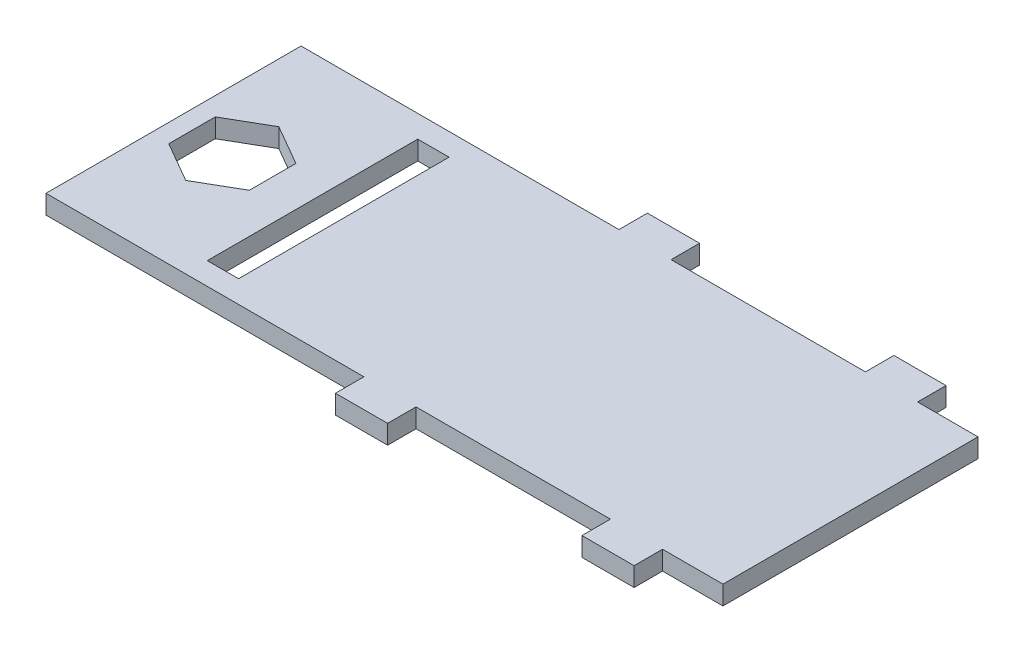
ISO-10303-21;
HEADER;
FILE_DESCRIPTION(('STEP AP214'),'2;1');
FILE_NAME('part.step','',(''),(''),'','','');
FILE_SCHEMA(('AUTOMOTIVE_DESIGN { 1 0 10303 214 1 1 1 1 }'));
ENDSEC;
DATA;
#1=APPLICATION_CONTEXT('core data for automotive mechanical design processes');
#2=APPLICATION_PROTOCOL_DEFINITION('international standard','automotive_design',2000,#1);
#3=PRODUCT_CONTEXT('',#1,'mechanical');
#4=PRODUCT('Part','Part','',(#3));
#5=PRODUCT_RELATED_PRODUCT_CATEGORY('part','',(#4));
#6=PRODUCT_DEFINITION_FORMATION('','',#4);
#7=PRODUCT_DEFINITION_CONTEXT('part definition',#1,'design');
#8=PRODUCT_DEFINITION('design','',#6,#7);
#9=PRODUCT_DEFINITION_SHAPE('','',#8);
#10=(LENGTH_UNIT() NAMED_UNIT(*) SI_UNIT(.MILLI.,.METRE.));
#11=(NAMED_UNIT(*) PLANE_ANGLE_UNIT() SI_UNIT($,.RADIAN.));
#12=(NAMED_UNIT(*) SI_UNIT($,.STERADIAN.) SOLID_ANGLE_UNIT());
#13=UNCERTAINTY_MEASURE_WITH_UNIT(LENGTH_MEASURE(1.E-05),#10,'distance_accuracy_value','');
#14=(GEOMETRIC_REPRESENTATION_CONTEXT(3) GLOBAL_UNCERTAINTY_ASSIGNED_CONTEXT((#13)) GLOBAL_UNIT_ASSIGNED_CONTEXT((#10,
#11,#12)) REPRESENTATION_CONTEXT('',''));
#15=CARTESIAN_POINT('',(0.,0.,0.));
#16=DIRECTION('',(0.,0.,1.));
#17=DIRECTION('',(1.,0.,0.));
#18=AXIS2_PLACEMENT_3D('',#15,#16,#17);
#19=CARTESIAN_POINT('',(-50.7984236509872,1.,18.7804542334295));
#20=DIRECTION('',(0.,0.,-1.));
#21=DIRECTION('',(-1.,0.,0.));
#22=AXIS2_PLACEMENT_3D('',#19,#20,#21);
#23=PLANE('',#22);
#24=DIRECTION('',(0.,-1.,0.));
#25=VECTOR('',#24,1.);
#26=CARTESIAN_POINT('',(-21.0334236509872,1.,18.7804542334295));
#27=LINE('',#26,#25);
#28=CARTESIAN_POINT('',(-21.0334236509872,1.,18.7804542334295));
#29=VERTEX_POINT('',#28);
#30=CARTESIAN_POINT('',(-21.0334236509872,0.,18.7804542334295));
#31=VERTEX_POINT('',#30);
#32=EDGE_CURVE('E327',#29,#31,#27,.T.);
#33=ORIENTED_EDGE('',*,*,#32,.F.);
#34=DIRECTION('',(1.,0.,0.));
#35=VECTOR('',#34,1.);
#36=CARTESIAN_POINT('',(-50.7984236509872,1.,18.7804542334295));
#37=LINE('',#36,#35);
#38=CARTESIAN_POINT('',(-31.2834236509872,1.,18.7804542334295));
#39=VERTEX_POINT('',#38);
#40=EDGE_CURVE('E513',#39,#29,#37,.T.);
#41=ORIENTED_EDGE('',*,*,#40,.F.);
#42=DIRECTION('',(0.,-1.,0.));
#43=VECTOR('',#42,1.);
#44=CARTESIAN_POINT('',(-31.2834236509872,1.,18.7804542334295));
#45=LINE('',#44,#43);
#46=CARTESIAN_POINT('',(-31.2834236509872,0.,18.7804542334295));
#47=VERTEX_POINT('',#46);
#48=EDGE_CURVE('E387',#39,#47,#45,.T.);
#49=ORIENTED_EDGE('',*,*,#48,.T.);
#50=DIRECTION('',(1.,0.,0.));
#51=VECTOR('',#50,1.);
#52=CARTESIAN_POINT('',(-50.7984236509872,0.,18.7804542334295));
#53=LINE('',#52,#51);
#54=EDGE_CURVE('E452',#47,#31,#53,.T.);
#55=ORIENTED_EDGE('',*,*,#54,.T.);
#56=EDGE_LOOP('',(#33,#41,#49,#55));
#57=FACE_BOUND('',#56,.T.);
#58=ADVANCED_FACE('F33',(#57),#23,.F.);
#59=DIRECTION('',(0.,-1.,0.));
#60=VECTOR('',#59,1.);
#61=CARTESIAN_POINT('',(-18.2834236509872,1.,18.7804542334295));
#62=LINE('',#61,#60);
#63=CARTESIAN_POINT('',(-18.2834236509872,1.,18.7804542334295));
#64=VERTEX_POINT('',#63);
#65=CARTESIAN_POINT('',(-18.2834236509872,0.,18.7804542334295));
#66=VERTEX_POINT('',#65);
#67=EDGE_CURVE('E336',#64,#66,#62,.T.);
#68=ORIENTED_EDGE('',*,*,#67,.T.);
#69=CARTESIAN_POINT('',(-15.0984236509872,0.,18.7804542334295));
#70=VERTEX_POINT('',#69);
#71=EDGE_CURVE('E446',#66,#70,#53,.T.);
#72=ORIENTED_EDGE('',*,*,#71,.T.);
#73=DIRECTION('',(0.,-1.,0.));
#74=VECTOR('',#73,1.);
#75=CARTESIAN_POINT('',(-15.0984236509872,1.,18.7804542334295));
#76=LINE('',#75,#74);
#77=CARTESIAN_POINT('',(-15.0984236509872,1.,18.7804542334295));
#78=VERTEX_POINT('',#77);
#79=EDGE_CURVE('E43',#78,#70,#76,.T.);
#80=ORIENTED_EDGE('',*,*,#79,.F.);
#81=EDGE_CURVE('E37',#64,#78,#37,.T.);
#82=ORIENTED_EDGE('',*,*,#81,.F.);
#83=EDGE_LOOP('',(#68,#72,#80,#82));
#84=FACE_BOUND('',#83,.T.);
#85=ADVANCED_FACE('F552',(#84),#23,.F.);
#86=CARTESIAN_POINT('',(-50.7984236509872,1.,5.33045423342954));
#87=DIRECTION('',(0.,0.,1.));
#88=DIRECTION('',(1.,0.,0.));
#89=AXIS2_PLACEMENT_3D('',#86,#87,#88);
#90=PLANE('',#89);
#91=DIRECTION('',(0.,-1.,0.));
#92=VECTOR('',#91,1.);
#93=CARTESIAN_POINT('',(-18.2834236509872,1.,5.33045423342954));
#94=LINE('',#93,#92);
#95=CARTESIAN_POINT('',(-18.2834236509872,1.,5.33045423342954));
#96=VERTEX_POINT('',#95);
#97=CARTESIAN_POINT('',(-18.2834236509872,0.,5.33045423342954));
#98=VERTEX_POINT('',#97);
#99=EDGE_CURVE('E368',#96,#98,#94,.T.);
#100=ORIENTED_EDGE('',*,*,#99,.F.);
#101=DIRECTION('',(-1.,0.,0.));
#102=VECTOR('',#101,1.);
#103=CARTESIAN_POINT('',(-50.7984236509872,1.,5.33045423342954));
#104=LINE('',#103,#102);
#105=CARTESIAN_POINT('',(-15.0984236509872,1.,5.33045423342954));
#106=VERTEX_POINT('',#105);
#107=EDGE_CURVE('E427',#106,#96,#104,.T.);
#108=ORIENTED_EDGE('',*,*,#107,.F.);
#109=DIRECTION('',(0.,-1.,0.));
#110=VECTOR('',#109,1.);
#111=CARTESIAN_POINT('',(-15.0984236509872,1.,5.33045423342954));
#112=LINE('',#111,#110);
#113=CARTESIAN_POINT('',(-15.0984236509872,0.,5.33045423342954));
#114=VERTEX_POINT('',#113);
#115=EDGE_CURVE('E420',#106,#114,#112,.T.);
#116=ORIENTED_EDGE('',*,*,#115,.T.);
#117=DIRECTION('',(-1.,0.,0.));
#118=VECTOR('',#117,1.);
#119=CARTESIAN_POINT('',(-50.7984236509872,0.,5.33045423342954));
#120=LINE('',#119,#118);
#121=EDGE_CURVE('E401',#114,#98,#120,.T.);
#122=ORIENTED_EDGE('',*,*,#121,.T.);
#123=EDGE_LOOP('',(#100,#108,#116,#122));
#124=FACE_BOUND('',#123,.T.);
#125=ADVANCED_FACE('F578',(#124),#90,.F.);
#126=DIRECTION('',(0.,-1.,0.));
#127=VECTOR('',#126,1.);
#128=CARTESIAN_POINT('',(-21.0334236509872,1.,5.33045423342954));
#129=LINE('',#128,#127);
#130=CARTESIAN_POINT('',(-21.0334236509872,1.,5.33045423342954));
#131=VERTEX_POINT('',#130);
#132=CARTESIAN_POINT('',(-21.0334236509872,0.,5.33045423342954));
#133=VERTEX_POINT('',#132);
#134=EDGE_CURVE('E354',#131,#133,#129,.T.);
#135=ORIENTED_EDGE('',*,*,#134,.T.);
#136=CARTESIAN_POINT('',(-31.2834236509872,0.,5.33045423342954));
#137=VERTEX_POINT('',#136);
#138=EDGE_CURVE('E398',#133,#137,#120,.T.);
#139=ORIENTED_EDGE('',*,*,#138,.T.);
#140=DIRECTION('',(0.,-1.,0.));
#141=VECTOR('',#140,1.);
#142=CARTESIAN_POINT('',(-31.2834236509872,1.,5.33045423342954));
#143=LINE('',#142,#141);
#144=CARTESIAN_POINT('',(-31.2834236509872,1.,5.33045423342954));
#145=VERTEX_POINT('',#144);
#146=EDGE_CURVE('E470',#145,#137,#143,.T.);
#147=ORIENTED_EDGE('',*,*,#146,.F.);
#148=EDGE_CURVE('E403',#131,#145,#104,.T.);
#149=ORIENTED_EDGE('',*,*,#148,.F.);
#150=EDGE_LOOP('',(#135,#139,#147,#149));
#151=FACE_BOUND('',#150,.T.);
#152=ADVANCED_FACE('F581',(#151),#90,.F.);
#153=DIRECTION('',(0.,-1.,0.));
#154=VECTOR('',#153,1.);
#155=CARTESIAN_POINT('',(-34.0334236509872,1.,18.7804542334295));
#156=LINE('',#155,#154);
#157=CARTESIAN_POINT('',(-34.0334236509872,1.,18.7804542334295));
#158=VERTEX_POINT('',#157);
#159=CARTESIAN_POINT('',(-34.0334236509872,0.,18.7804542334295));
#160=VERTEX_POINT('',#159);
#161=EDGE_CURVE('E384',#158,#160,#156,.T.);
#162=ORIENTED_EDGE('',*,*,#161,.F.);
#163=CARTESIAN_POINT('',(-50.7984236509872,1.,18.7804542334295));
#164=VERTEX_POINT('',#163);
#165=EDGE_CURVE('E510',#164,#158,#37,.T.);
#166=ORIENTED_EDGE('',*,*,#165,.F.);
#167=DIRECTION('',(0.,-1.,0.));
#168=VECTOR('',#167,1.);
#169=CARTESIAN_POINT('',(-50.7984236509872,1.,18.7804542334295));
#170=LINE('',#169,#168);
#171=CARTESIAN_POINT('',(-50.7984236509872,0.,18.7804542334295));
#172=VERTEX_POINT('',#171);
#173=EDGE_CURVE('E11',#164,#172,#170,.T.);
#174=ORIENTED_EDGE('',*,*,#173,.T.);
#175=EDGE_CURVE('E455',#172,#160,#53,.T.);
#176=ORIENTED_EDGE('',*,*,#175,.T.);
#177=EDGE_LOOP('',(#162,#166,#174,#176));
#178=FACE_BOUND('',#177,.T.);
#179=ADVANCED_FACE('F556',(#178),#23,.F.);
#180=CARTESIAN_POINT('',(-50.7984236509872,1.,5.33045423342954));
#181=DIRECTION('',(1.,0.,0.));
#182=DIRECTION('',(0.,0.,-1.));
#183=AXIS2_PLACEMENT_3D('',#180,#181,#182);
#184=PLANE('',#183);
#185=DIRECTION('',(0.,0.,1.));
#186=VECTOR('',#185,1.);
#187=CARTESIAN_POINT('',(-50.7984236509872,0.,5.33045423342954));
#188=LINE('',#187,#186);
#189=CARTESIAN_POINT('',(-50.7984236509872,0.,5.33045423342954));
#190=VERTEX_POINT('',#189);
#191=EDGE_CURVE('E443',#190,#172,#188,.T.);
#192=ORIENTED_EDGE('',*,*,#191,.T.);
#193=ORIENTED_EDGE('',*,*,#173,.F.);
#194=DIRECTION('',(0.,0.,1.));
#195=VECTOR('',#194,1.);
#196=CARTESIAN_POINT('',(-50.7984236509872,1.,5.33045423342954));
#197=LINE('',#196,#195);
#198=CARTESIAN_POINT('',(-50.7984236509872,1.,5.33045423342954));
#199=VERTEX_POINT('',#198);
#200=EDGE_CURVE('E417',#199,#164,#197,.T.);
#201=ORIENTED_EDGE('',*,*,#200,.F.);
#202=DIRECTION('',(0.,-1.,0.));
#203=VECTOR('',#202,1.);
#204=CARTESIAN_POINT('',(-50.7984236509872,1.,5.33045423342954));
#205=LINE('',#204,#203);
#206=EDGE_CURVE('E410',#199,#190,#205,.T.);
#207=ORIENTED_EDGE('',*,*,#206,.T.);
#208=EDGE_LOOP('',(#192,#193,#201,#207));
#209=FACE_BOUND('',#208,.T.);
#210=ADVANCED_FACE('F35',(#209),#184,.F.);
#211=CARTESIAN_POINT('',(-15.0984236509872,1.,5.33045423342954));
#212=DIRECTION('',(-1.,0.,0.));
#213=DIRECTION('',(0.,0.,1.));
#214=AXIS2_PLACEMENT_3D('',#211,#212,#213);
#215=PLANE('',#214);
#216=DIRECTION('',(0.,0.,-1.));
#217=VECTOR('',#216,1.);
#218=CARTESIAN_POINT('',(-15.0984236509872,0.,5.33045423342954));
#219=LINE('',#218,#217);
#220=EDGE_CURVE('E408',#70,#114,#219,.T.);
#221=ORIENTED_EDGE('',*,*,#220,.T.);
#222=ORIENTED_EDGE('',*,*,#115,.F.);
#223=DIRECTION('',(0.,0.,-1.));
#224=VECTOR('',#223,1.);
#225=CARTESIAN_POINT('',(-15.0984236509872,1.,5.33045423342954));
#226=LINE('',#225,#224);
#227=EDGE_CURVE('E442',#78,#106,#226,.T.);
#228=ORIENTED_EDGE('',*,*,#227,.F.);
#229=ORIENTED_EDGE('',*,*,#79,.T.);
#230=EDGE_LOOP('',(#221,#222,#228,#229));
#231=FACE_BOUND('',#230,.T.);
#232=ADVANCED_FACE('F586',(#231),#215,.F.);
#233=CARTESIAN_POINT('',(-34.0334236509872,1.,5.33045423342954));
#234=VERTEX_POINT('',#233);
#235=EDGE_CURVE('E436',#234,#199,#104,.T.);
#236=ORIENTED_EDGE('',*,*,#235,.F.);
#237=DIRECTION('',(0.,-1.,0.));
#238=VECTOR('',#237,1.);
#239=CARTESIAN_POINT('',(-34.0334236509872,1.,5.33045423342954));
#240=LINE('',#239,#238);
#241=CARTESIAN_POINT('',(-34.0334236509872,0.,5.33045423342954));
#242=VERTEX_POINT('',#241);
#243=EDGE_CURVE('E447',#234,#242,#240,.T.);
#244=ORIENTED_EDGE('',*,*,#243,.T.);
#245=EDGE_CURVE('E402',#242,#190,#120,.T.);
#246=ORIENTED_EDGE('',*,*,#245,.T.);
#247=ORIENTED_EDGE('',*,*,#206,.F.);
#248=EDGE_LOOP('',(#236,#244,#246,#247));
#249=FACE_BOUND('',#248,.T.);
#250=ADVANCED_FACE('F509',(#249),#90,.F.);
#251=CARTESIAN_POINT('',(0.,1.,0.));
#252=DIRECTION('',(0.,1.,0.));
#253=DIRECTION('',(0.,0.,1.));
#254=AXIS2_PLACEMENT_3D('',#251,#252,#253);
#255=PLANE('',#254);
#256=DIRECTION('',(-0.866025403784439,0.,-0.5));
#257=VECTOR('',#256,1.);
#258=CARTESIAN_POINT('',(-47.6984236509872,1.,14.5091928774854));
#259=LINE('',#258,#257);
#260=CARTESIAN_POINT('',(-47.6984236509872,1.,14.5091928774854));
#261=VERTEX_POINT('',#260);
#262=CARTESIAN_POINT('',(-49.8234236509872,1.,13.2823235554575));
#263=VERTEX_POINT('',#262);
#264=EDGE_CURVE('E235',#261,#263,#259,.T.);
#265=ORIENTED_EDGE('',*,*,#264,.T.);
#266=DIRECTION('',(0.,0.,-1.));
#267=VECTOR('',#266,1.);
#268=CARTESIAN_POINT('',(-49.8234236509872,1.,13.2823235554575));
#269=LINE('',#268,#267);
#270=CARTESIAN_POINT('',(-49.8234236509872,1.,10.8285849114016));
#271=VERTEX_POINT('',#270);
#272=EDGE_CURVE('E244',#263,#271,#269,.T.);
#273=ORIENTED_EDGE('',*,*,#272,.T.);
#274=DIRECTION('',(0.866025403784439,0.,-0.5));
#275=VECTOR('',#274,1.);
#276=CARTESIAN_POINT('',(-49.8234236509872,1.,10.8285849114016));
#277=LINE('',#276,#275);
#278=CARTESIAN_POINT('',(-47.6984236509872,1.,9.60171558937365));
#279=VERTEX_POINT('',#278);
#280=EDGE_CURVE('E51',#271,#279,#277,.T.);
#281=ORIENTED_EDGE('',*,*,#280,.T.);
#282=DIRECTION('',(0.866025403784438,0.,0.5));
#283=VECTOR('',#282,1.);
#284=CARTESIAN_POINT('',(-47.6984236509872,1.,9.60171558937365));
#285=LINE('',#284,#283);
#286=CARTESIAN_POINT('',(-45.5734236509872,1.,10.8285849114016));
#287=VERTEX_POINT('',#286);
#288=EDGE_CURVE('E259',#279,#287,#285,.T.);
#289=ORIENTED_EDGE('',*,*,#288,.T.);
#290=DIRECTION('',(0.,0.,1.));
#291=VECTOR('',#290,1.);
#292=CARTESIAN_POINT('',(-45.5734236509872,1.,10.8285849114016));
#293=LINE('',#292,#291);
#294=CARTESIAN_POINT('',(-45.5734236509872,1.,13.2823235554575));
#295=VERTEX_POINT('',#294);
#296=EDGE_CURVE('E262',#287,#295,#293,.T.);
#297=ORIENTED_EDGE('',*,*,#296,.T.);
#298=DIRECTION('',(-0.866025403784439,0.,0.5));
#299=VECTOR('',#298,1.);
#300=CARTESIAN_POINT('',(-45.5734236509872,1.,13.2823235554575));
#301=LINE('',#300,#299);
#302=EDGE_CURVE('E241',#295,#261,#301,.T.);
#303=ORIENTED_EDGE('',*,*,#302,.T.);
#304=EDGE_LOOP('',(#265,#273,#281,#289,#297,#303));
#305=FACE_BOUND('',#304,.T.);
#306=DIRECTION('',(0.,0.,-1.));
#307=VECTOR('',#306,1.);
#308=CARTESIAN_POINT('',(-43.4684236509872,1.,17.6054542334295));
#309=LINE('',#308,#307);
#310=CARTESIAN_POINT('',(-43.4684236509872,1.,17.6054542334295));
#311=VERTEX_POINT('',#310);
#312=CARTESIAN_POINT('',(-43.4684236509872,1.,6.50545423342955));
#313=VERTEX_POINT('',#312);
#314=EDGE_CURVE('E286',#311,#313,#309,.T.);
#315=ORIENTED_EDGE('',*,*,#314,.T.);
#316=DIRECTION('',(1.,0.,0.));
#317=VECTOR('',#316,1.);
#318=CARTESIAN_POINT('',(-43.4684236509872,1.,6.50545423342955));
#319=LINE('',#318,#317);
#320=CARTESIAN_POINT('',(-41.8184236509872,1.,6.50545423342955));
#321=VERTEX_POINT('',#320);
#322=EDGE_CURVE('E289',#313,#321,#319,.T.);
#323=ORIENTED_EDGE('',*,*,#322,.T.);
#324=DIRECTION('',(0.,0.,1.));
#325=VECTOR('',#324,1.);
#326=CARTESIAN_POINT('',(-41.8184236509872,1.,17.6054542334296));
#327=LINE('',#326,#325);
#328=CARTESIAN_POINT('',(-41.8184236509872,1.,17.6054542334296));
#329=VERTEX_POINT('',#328);
#330=EDGE_CURVE('E293',#321,#329,#327,.T.);
#331=ORIENTED_EDGE('',*,*,#330,.T.);
#332=DIRECTION('',(-1.,0.,0.));
#333=VECTOR('',#332,1.);
#334=CARTESIAN_POINT('',(-43.4684236509872,1.,17.6054542334295));
#335=LINE('',#334,#333);
#336=EDGE_CURVE('E296',#329,#311,#335,.T.);
#337=ORIENTED_EDGE('',*,*,#336,.T.);
#338=EDGE_LOOP('',(#315,#323,#331,#337));
#339=FACE_BOUND('',#338,.T.);
#340=ORIENTED_EDGE('',*,*,#200,.T.);
#341=ORIENTED_EDGE('',*,*,#165,.T.);
#342=DIRECTION('',(0.,0.,1.));
#343=VECTOR('',#342,1.);
#344=CARTESIAN_POINT('',(-34.0334236509872,1.,18.7804542334295));
#345=LINE('',#344,#343);
#346=CARTESIAN_POINT('',(-34.0334236509872,1.,20.2804542334295));
#347=VERTEX_POINT('',#346);
#348=EDGE_CURVE('E375',#158,#347,#345,.T.);
#349=ORIENTED_EDGE('',*,*,#348,.T.);
#350=DIRECTION('',(1.,0.,0.));
#351=VECTOR('',#350,1.);
#352=CARTESIAN_POINT('',(-34.0334236509872,1.,20.2804542334295));
#353=LINE('',#352,#351);
#354=CARTESIAN_POINT('',(-31.2834236509872,1.,20.2804542334295));
#355=VERTEX_POINT('',#354);
#356=EDGE_CURVE('E372',#347,#355,#353,.T.);
#357=ORIENTED_EDGE('',*,*,#356,.T.);
#358=DIRECTION('',(0.,0.,-1.));
#359=VECTOR('',#358,1.);
#360=CARTESIAN_POINT('',(-31.2834236509872,1.,18.7804542334295));
#361=LINE('',#360,#359);
#362=EDGE_CURVE('E374',#355,#39,#361,.T.);
#363=ORIENTED_EDGE('',*,*,#362,.T.);
#364=ORIENTED_EDGE('',*,*,#40,.T.);
#365=DIRECTION('',(0.,0.,1.));
#366=VECTOR('',#365,1.);
#367=CARTESIAN_POINT('',(-21.0334236509872,1.,18.7804542334295));
#368=LINE('',#367,#366);
#369=CARTESIAN_POINT('',(-21.0334236509872,1.,20.2804542334295));
#370=VERTEX_POINT('',#369);
#371=EDGE_CURVE('E318',#29,#370,#368,.T.);
#372=ORIENTED_EDGE('',*,*,#371,.T.);
#373=DIRECTION('',(1.,0.,0.));
#374=VECTOR('',#373,1.);
#375=CARTESIAN_POINT('',(-21.0334236509872,1.,20.2804542334295));
#376=LINE('',#375,#374);
#377=CARTESIAN_POINT('',(-18.2834236509872,1.,20.2804542334295));
#378=VERTEX_POINT('',#377);
#379=EDGE_CURVE('E321',#370,#378,#376,.T.);
#380=ORIENTED_EDGE('',*,*,#379,.T.);
#381=DIRECTION('',(0.,0.,-1.));
#382=VECTOR('',#381,1.);
#383=CARTESIAN_POINT('',(-18.2834236509872,1.,18.7804542334295));
#384=LINE('',#383,#382);
#385=EDGE_CURVE('E324',#378,#64,#384,.T.);
#386=ORIENTED_EDGE('',*,*,#385,.T.);
#387=ORIENTED_EDGE('',*,*,#81,.T.);
#388=ORIENTED_EDGE('',*,*,#227,.T.);
#389=ORIENTED_EDGE('',*,*,#107,.T.);
#390=DIRECTION('',(0.,0.,-1.));
#391=VECTOR('',#390,1.);
#392=CARTESIAN_POINT('',(-18.2834236509872,1.,5.33045423342954));
#393=LINE('',#392,#391);
#394=CARTESIAN_POINT('',(-18.2834236509872,1.,3.83045423342955));
#395=VERTEX_POINT('',#394);
#396=EDGE_CURVE('E346',#96,#395,#393,.T.);
#397=ORIENTED_EDGE('',*,*,#396,.T.);
#398=DIRECTION('',(-1.,0.,0.));
#399=VECTOR('',#398,1.);
#400=CARTESIAN_POINT('',(-21.0334236509872,1.,3.83045423342955));
#401=LINE('',#400,#399);
#402=CARTESIAN_POINT('',(-21.0334236509872,1.,3.83045423342955));
#403=VERTEX_POINT('',#402);
#404=EDGE_CURVE('E348',#395,#403,#401,.T.);
#405=ORIENTED_EDGE('',*,*,#404,.T.);
#406=DIRECTION('',(0.,0.,1.));
#407=VECTOR('',#406,1.);
#408=CARTESIAN_POINT('',(-21.0334236509872,1.,5.33045423342954));
#409=LINE('',#408,#407);
#410=EDGE_CURVE('E351',#403,#131,#409,.T.);
#411=ORIENTED_EDGE('',*,*,#410,.T.);
#412=ORIENTED_EDGE('',*,*,#148,.T.);
#413=DIRECTION('',(0.,0.,-1.));
#414=VECTOR('',#413,1.);
#415=CARTESIAN_POINT('',(-31.2834236509872,1.,5.33045423342954));
#416=LINE('',#415,#414);
#417=CARTESIAN_POINT('',(-31.2834236509872,1.,3.83045423342955));
#418=VERTEX_POINT('',#417);
#419=EDGE_CURVE('E466',#145,#418,#416,.T.);
#420=ORIENTED_EDGE('',*,*,#419,.T.);
#421=DIRECTION('',(-1.,0.,0.));
#422=VECTOR('',#421,1.);
#423=CARTESIAN_POINT('',(-34.0334236509872,1.,3.83045423342955));
#424=LINE('',#423,#422);
#425=CARTESIAN_POINT('',(-34.0334236509872,1.,3.83045423342955));
#426=VERTEX_POINT('',#425);
#427=EDGE_CURVE('E468',#418,#426,#424,.T.);
#428=ORIENTED_EDGE('',*,*,#427,.T.);
#429=DIRECTION('',(0.,0.,1.));
#430=VECTOR('',#429,1.);
#431=CARTESIAN_POINT('',(-34.0334236509872,1.,5.33045423342954));
#432=LINE('',#431,#430);
#433=EDGE_CURVE('E469',#426,#234,#432,.T.);
#434=ORIENTED_EDGE('',*,*,#433,.T.);
#435=ORIENTED_EDGE('',*,*,#235,.T.);
#436=EDGE_LOOP('',(#340,#341,#349,#357,#363,#364,#372,#380,#386,#387,#388,#389,#397,#405,#411,
#412,#420,#428,#434,#435));
#437=FACE_BOUND('',#436,.T.);
#438=ADVANCED_FACE('F248',(#305,#339,#437),#255,.T.);
#439=CARTESIAN_POINT('',(0.,0.,0.));
#440=DIRECTION('',(0.,1.,0.));
#441=DIRECTION('',(0.,0.,1.));
#442=AXIS2_PLACEMENT_3D('',#439,#440,#441);
#443=PLANE('',#442);
#444=DIRECTION('',(0.,0.,-1.));
#445=VECTOR('',#444,1.);
#446=CARTESIAN_POINT('',(-49.8234236509872,0.,13.2823235554575));
#447=LINE('',#446,#445);
#448=CARTESIAN_POINT('',(-49.8234236509872,0.,13.2823235554575));
#449=VERTEX_POINT('',#448);
#450=CARTESIAN_POINT('',(-49.8234236509872,0.,10.8285849114016));
#451=VERTEX_POINT('',#450);
#452=EDGE_CURVE('E266',#449,#451,#447,.T.);
#453=ORIENTED_EDGE('',*,*,#452,.F.);
#454=DIRECTION('',(-0.866025403784439,0.,-0.5));
#455=VECTOR('',#454,1.);
#456=CARTESIAN_POINT('',(-47.6984236509872,0.,14.5091928774854));
#457=LINE('',#456,#455);
#458=CARTESIAN_POINT('',(-47.6984236509872,0.,14.5091928774854));
#459=VERTEX_POINT('',#458);
#460=EDGE_CURVE('E59',#459,#449,#457,.T.);
#461=ORIENTED_EDGE('',*,*,#460,.F.);
#462=DIRECTION('',(-0.866025403784439,0.,0.5));
#463=VECTOR('',#462,1.);
#464=CARTESIAN_POINT('',(-45.5734236509872,0.,13.2823235554575));
#465=LINE('',#464,#463);
#466=CARTESIAN_POINT('',(-45.5734236509872,0.,13.2823235554575));
#467=VERTEX_POINT('',#466);
#468=EDGE_CURVE('E252',#467,#459,#465,.T.);
#469=ORIENTED_EDGE('',*,*,#468,.F.);
#470=DIRECTION('',(0.,0.,1.));
#471=VECTOR('',#470,1.);
#472=CARTESIAN_POINT('',(-45.5734236509872,0.,10.8285849114016));
#473=LINE('',#472,#471);
#474=CARTESIAN_POINT('',(-45.5734236509872,0.,10.8285849114016));
#475=VERTEX_POINT('',#474);
#476=EDGE_CURVE('E255',#475,#467,#473,.T.);
#477=ORIENTED_EDGE('',*,*,#476,.F.);
#478=DIRECTION('',(0.866025403784438,0.,0.5));
#479=VECTOR('',#478,1.);
#480=CARTESIAN_POINT('',(-47.6984236509872,0.,9.60171558937365));
#481=LINE('',#480,#479);
#482=CARTESIAN_POINT('',(-47.6984236509872,0.,9.60171558937365));
#483=VERTEX_POINT('',#482);
#484=EDGE_CURVE('E271',#483,#475,#481,.T.);
#485=ORIENTED_EDGE('',*,*,#484,.F.);
#486=DIRECTION('',(0.866025403784439,0.,-0.5));
#487=VECTOR('',#486,1.);
#488=CARTESIAN_POINT('',(-49.8234236509872,0.,10.8285849114016));
#489=LINE('',#488,#487);
#490=EDGE_CURVE('E268',#451,#483,#489,.T.);
#491=ORIENTED_EDGE('',*,*,#490,.F.);
#492=EDGE_LOOP('',(#453,#461,#469,#477,#485,#491));
#493=FACE_BOUND('',#492,.T.);
#494=DIRECTION('',(1.,0.,0.));
#495=VECTOR('',#494,1.);
#496=CARTESIAN_POINT('',(-43.4684236509872,0.,6.50545423342955));
#497=LINE('',#496,#495);
#498=CARTESIAN_POINT('',(-43.4684236509872,0.,6.50545423342955));
#499=VERTEX_POINT('',#498);
#500=CARTESIAN_POINT('',(-41.8184236509872,0.,6.50545423342955));
#501=VERTEX_POINT('',#500);
#502=EDGE_CURVE('E301',#499,#501,#497,.T.);
#503=ORIENTED_EDGE('',*,*,#502,.F.);
#504=DIRECTION('',(0.,0.,-1.));
#505=VECTOR('',#504,1.);
#506=CARTESIAN_POINT('',(-43.4684236509872,0.,17.6054542334295));
#507=LINE('',#506,#505);
#508=CARTESIAN_POINT('',(-43.4684236509872,0.,17.6054542334295));
#509=VERTEX_POINT('',#508);
#510=EDGE_CURVE('E278',#509,#499,#507,.T.);
#511=ORIENTED_EDGE('',*,*,#510,.F.);
#512=DIRECTION('',(-1.,0.,0.));
#513=VECTOR('',#512,1.);
#514=CARTESIAN_POINT('',(-43.4684236509872,0.,17.6054542334295));
#515=LINE('',#514,#513);
#516=CARTESIAN_POINT('',(-41.8184236509872,0.,17.6054542334296));
#517=VERTEX_POINT('',#516);
#518=EDGE_CURVE('E290',#517,#509,#515,.T.);
#519=ORIENTED_EDGE('',*,*,#518,.F.);
#520=DIRECTION('',(0.,0.,1.));
#521=VECTOR('',#520,1.);
#522=CARTESIAN_POINT('',(-41.8184236509872,0.,17.6054542334296));
#523=LINE('',#522,#521);
#524=EDGE_CURVE('E304',#501,#517,#523,.T.);
#525=ORIENTED_EDGE('',*,*,#524,.F.);
#526=EDGE_LOOP('',(#503,#511,#519,#525));
#527=FACE_BOUND('',#526,.T.);
#528=ORIENTED_EDGE('',*,*,#191,.F.);
#529=ORIENTED_EDGE('',*,*,#245,.F.);
#530=DIRECTION('',(0.,0.,1.));
#531=VECTOR('',#530,1.);
#532=CARTESIAN_POINT('',(-34.0334236509872,0.,5.33045423342954));
#533=LINE('',#532,#531);
#534=CARTESIAN_POINT('',(-34.0334236509872,0.,3.83045423342955));
#535=VERTEX_POINT('',#534);
#536=EDGE_CURVE('E463',#535,#242,#533,.T.);
#537=ORIENTED_EDGE('',*,*,#536,.F.);
#538=DIRECTION('',(-1.,0.,0.));
#539=VECTOR('',#538,1.);
#540=CARTESIAN_POINT('',(-34.0334236509872,0.,3.83045423342955));
#541=LINE('',#540,#539);
#542=CARTESIAN_POINT('',(-31.2834236509872,0.,3.83045423342955));
#543=VERTEX_POINT('',#542);
#544=EDGE_CURVE('E462',#543,#535,#541,.T.);
#545=ORIENTED_EDGE('',*,*,#544,.F.);
#546=DIRECTION('',(0.,0.,-1.));
#547=VECTOR('',#546,1.);
#548=CARTESIAN_POINT('',(-31.2834236509872,0.,5.33045423342954));
#549=LINE('',#548,#547);
#550=EDGE_CURVE('E460',#137,#543,#549,.T.);
#551=ORIENTED_EDGE('',*,*,#550,.F.);
#552=ORIENTED_EDGE('',*,*,#138,.F.);
#553=DIRECTION('',(0.,0.,1.));
#554=VECTOR('',#553,1.);
#555=CARTESIAN_POINT('',(-21.0334236509872,0.,5.33045423342954));
#556=LINE('',#555,#554);
#557=CARTESIAN_POINT('',(-21.0334236509872,0.,3.83045423342955));
#558=VERTEX_POINT('',#557);
#559=EDGE_CURVE('E349',#558,#133,#556,.T.);
#560=ORIENTED_EDGE('',*,*,#559,.F.);
#561=DIRECTION('',(-1.,0.,0.));
#562=VECTOR('',#561,1.);
#563=CARTESIAN_POINT('',(-21.0334236509872,0.,3.83045423342955));
#564=LINE('',#563,#562);
#565=CARTESIAN_POINT('',(-18.2834236509872,0.,3.83045423342955));
#566=VERTEX_POINT('',#565);
#567=EDGE_CURVE('E356',#566,#558,#564,.T.);
#568=ORIENTED_EDGE('',*,*,#567,.F.);
#569=DIRECTION('',(0.,0.,-1.));
#570=VECTOR('',#569,1.);
#571=CARTESIAN_POINT('',(-18.2834236509872,0.,5.33045423342954));
#572=LINE('',#571,#570);
#573=EDGE_CURVE('E345',#98,#566,#572,.T.);
#574=ORIENTED_EDGE('',*,*,#573,.F.);
#575=ORIENTED_EDGE('',*,*,#121,.F.);
#576=ORIENTED_EDGE('',*,*,#220,.F.);
#577=ORIENTED_EDGE('',*,*,#71,.F.);
#578=DIRECTION('',(0.,0.,-1.));
#579=VECTOR('',#578,1.);
#580=CARTESIAN_POINT('',(-18.2834236509872,0.,18.7804542334295));
#581=LINE('',#580,#579);
#582=CARTESIAN_POINT('',(-18.2834236509872,0.,20.2804542334295));
#583=VERTEX_POINT('',#582);
#584=EDGE_CURVE('E322',#583,#66,#581,.T.);
#585=ORIENTED_EDGE('',*,*,#584,.F.);
#586=DIRECTION('',(1.,0.,0.));
#587=VECTOR('',#586,1.);
#588=CARTESIAN_POINT('',(-21.0334236509872,0.,20.2804542334295));
#589=LINE('',#588,#587);
#590=CARTESIAN_POINT('',(-21.0334236509872,0.,20.2804542334295));
#591=VERTEX_POINT('',#590);
#592=EDGE_CURVE('E330',#591,#583,#589,.T.);
#593=ORIENTED_EDGE('',*,*,#592,.F.);
#594=DIRECTION('',(0.,0.,1.));
#595=VECTOR('',#594,1.);
#596=CARTESIAN_POINT('',(-21.0334236509872,0.,18.7804542334295));
#597=LINE('',#596,#595);
#598=EDGE_CURVE('E311',#31,#591,#597,.T.);
#599=ORIENTED_EDGE('',*,*,#598,.F.);
#600=ORIENTED_EDGE('',*,*,#54,.F.);
#601=DIRECTION('',(0.,0.,-1.));
#602=VECTOR('',#601,1.);
#603=CARTESIAN_POINT('',(-31.2834236509872,0.,18.7804542334295));
#604=LINE('',#603,#602);
#605=CARTESIAN_POINT('',(-31.2834236509872,0.,20.2804542334295));
#606=VERTEX_POINT('',#605);
#607=EDGE_CURVE('E378',#606,#47,#604,.T.);
#608=ORIENTED_EDGE('',*,*,#607,.F.);
#609=DIRECTION('',(1.,0.,0.));
#610=VECTOR('',#609,1.);
#611=CARTESIAN_POINT('',(-34.0334236509872,0.,20.2804542334295));
#612=LINE('',#611,#610);
#613=CARTESIAN_POINT('',(-34.0334236509872,0.,20.2804542334295));
#614=VERTEX_POINT('',#613);
#615=EDGE_CURVE('E376',#614,#606,#612,.T.);
#616=ORIENTED_EDGE('',*,*,#615,.F.);
#617=DIRECTION('',(0.,0.,1.));
#618=VECTOR('',#617,1.);
#619=CARTESIAN_POINT('',(-34.0334236509872,0.,18.7804542334295));
#620=LINE('',#619,#618);
#621=EDGE_CURVE('E371',#160,#614,#620,.T.);
#622=ORIENTED_EDGE('',*,*,#621,.F.);
#623=ORIENTED_EDGE('',*,*,#175,.F.);
#624=EDGE_LOOP('',(#528,#529,#537,#545,#551,#552,#560,#568,#574,#575,#576,#577,#585,#593,#599,
#600,#608,#616,#622,#623));
#625=FACE_BOUND('',#624,.T.);
#626=ADVANCED_FACE('F541',(#493,#527,#625),#443,.F.);
#627=CARTESIAN_POINT('',(-34.0334236509872,1.,5.33045423342954));
#628=DIRECTION('',(1.,0.,0.));
#629=DIRECTION('',(0.,0.,-1.));
#630=AXIS2_PLACEMENT_3D('',#627,#628,#629);
#631=PLANE('',#630);
#632=ORIENTED_EDGE('',*,*,#536,.T.);
#633=ORIENTED_EDGE('',*,*,#243,.F.);
#634=ORIENTED_EDGE('',*,*,#433,.F.);
#635=DIRECTION('',(0.,-1.,0.));
#636=VECTOR('',#635,1.);
#637=CARTESIAN_POINT('',(-34.0334236509872,1.,3.83045423342955));
#638=LINE('',#637,#636);
#639=EDGE_CURVE('E497',#426,#535,#638,.T.);
#640=ORIENTED_EDGE('',*,*,#639,.T.);
#641=EDGE_LOOP('',(#632,#633,#634,#640));
#642=FACE_BOUND('',#641,.T.);
#643=ADVANCED_FACE('F505',(#642),#631,.F.);
#644=CARTESIAN_POINT('',(-31.2834236509872,1.,5.33045423342954));
#645=DIRECTION('',(-1.,0.,0.));
#646=DIRECTION('',(0.,0.,1.));
#647=AXIS2_PLACEMENT_3D('',#644,#645,#646);
#648=PLANE('',#647);
#649=ORIENTED_EDGE('',*,*,#550,.T.);
#650=DIRECTION('',(0.,-1.,0.));
#651=VECTOR('',#650,1.);
#652=CARTESIAN_POINT('',(-31.2834236509872,1.,3.83045423342955));
#653=LINE('',#652,#651);
#654=EDGE_CURVE('E474',#418,#543,#653,.T.);
#655=ORIENTED_EDGE('',*,*,#654,.F.);
#656=ORIENTED_EDGE('',*,*,#419,.F.);
#657=ORIENTED_EDGE('',*,*,#146,.T.);
#658=EDGE_LOOP('',(#649,#655,#656,#657));
#659=FACE_BOUND('',#658,.T.);
#660=ADVANCED_FACE('F607',(#659),#648,.F.);
#661=CARTESIAN_POINT('',(-34.0334236509872,1.,3.83045423342955));
#662=DIRECTION('',(0.,0.,1.));
#663=DIRECTION('',(1.,0.,0.));
#664=AXIS2_PLACEMENT_3D('',#661,#662,#663);
#665=PLANE('',#664);
#666=ORIENTED_EDGE('',*,*,#544,.T.);
#667=ORIENTED_EDGE('',*,*,#639,.F.);
#668=ORIENTED_EDGE('',*,*,#427,.F.);
#669=ORIENTED_EDGE('',*,*,#654,.T.);
#670=EDGE_LOOP('',(#666,#667,#668,#669));
#671=FACE_BOUND('',#670,.T.);
#672=ADVANCED_FACE('F504',(#671),#665,.F.);
#673=CARTESIAN_POINT('',(-34.0334236509872,1.,18.7804542334295));
#674=DIRECTION('',(1.,0.,0.));
#675=DIRECTION('',(0.,0.,-1.));
#676=AXIS2_PLACEMENT_3D('',#673,#674,#675);
#677=PLANE('',#676);
#678=ORIENTED_EDGE('',*,*,#621,.T.);
#679=DIRECTION('',(0.,-1.,0.));
#680=VECTOR('',#679,1.);
#681=CARTESIAN_POINT('',(-34.0334236509872,1.,20.2804542334295));
#682=LINE('',#681,#680);
#683=EDGE_CURVE('E563',#347,#614,#682,.T.);
#684=ORIENTED_EDGE('',*,*,#683,.F.);
#685=ORIENTED_EDGE('',*,*,#348,.F.);
#686=ORIENTED_EDGE('',*,*,#161,.T.);
#687=EDGE_LOOP('',(#678,#684,#685,#686));
#688=FACE_BOUND('',#687,.T.);
#689=ADVANCED_FACE('F559',(#688),#677,.F.);
#690=CARTESIAN_POINT('',(-34.0334236509872,1.,20.2804542334295));
#691=DIRECTION('',(0.,0.,-1.));
#692=DIRECTION('',(-1.,0.,0.));
#693=AXIS2_PLACEMENT_3D('',#690,#691,#692);
#694=PLANE('',#693);
#695=ORIENTED_EDGE('',*,*,#615,.T.);
#696=DIRECTION('',(0.,-1.,0.));
#697=VECTOR('',#696,1.);
#698=CARTESIAN_POINT('',(-31.2834236509872,1.,20.2804542334295));
#699=LINE('',#698,#697);
#700=EDGE_CURVE('E522',#355,#606,#699,.T.);
#701=ORIENTED_EDGE('',*,*,#700,.F.);
#702=ORIENTED_EDGE('',*,*,#356,.F.);
#703=ORIENTED_EDGE('',*,*,#683,.T.);
#704=EDGE_LOOP('',(#695,#701,#702,#703));
#705=FACE_BOUND('',#704,.T.);
#706=ADVANCED_FACE('F564',(#705),#694,.F.);
#707=CARTESIAN_POINT('',(-31.2834236509872,1.,18.7804542334295));
#708=DIRECTION('',(-1.,0.,0.));
#709=DIRECTION('',(0.,0.,1.));
#710=AXIS2_PLACEMENT_3D('',#707,#708,#709);
#711=PLANE('',#710);
#712=ORIENTED_EDGE('',*,*,#607,.T.);
#713=ORIENTED_EDGE('',*,*,#48,.F.);
#714=ORIENTED_EDGE('',*,*,#362,.F.);
#715=ORIENTED_EDGE('',*,*,#700,.T.);
#716=EDGE_LOOP('',(#712,#713,#714,#715));
#717=FACE_BOUND('',#716,.T.);
#718=ADVANCED_FACE('F532',(#717),#711,.F.);
#719=CARTESIAN_POINT('',(-18.2834236509872,1.,5.33045423342954));
#720=DIRECTION('',(-1.,0.,0.));
#721=DIRECTION('',(0.,0.,1.));
#722=AXIS2_PLACEMENT_3D('',#719,#720,#721);
#723=PLANE('',#722);
#724=ORIENTED_EDGE('',*,*,#573,.T.);
#725=DIRECTION('',(0.,-1.,0.));
#726=VECTOR('',#725,1.);
#727=CARTESIAN_POINT('',(-18.2834236509872,1.,3.83045423342955));
#728=LINE('',#727,#726);
#729=EDGE_CURVE('E365',#395,#566,#728,.T.);
#730=ORIENTED_EDGE('',*,*,#729,.F.);
#731=ORIENTED_EDGE('',*,*,#396,.F.);
#732=ORIENTED_EDGE('',*,*,#99,.T.);
#733=EDGE_LOOP('',(#724,#730,#731,#732));
#734=FACE_BOUND('',#733,.T.);
#735=ADVANCED_FACE('F571',(#734),#723,.F.);
#736=CARTESIAN_POINT('',(-21.0334236509872,1.,3.83045423342955));
#737=DIRECTION('',(0.,0.,1.));
#738=DIRECTION('',(1.,0.,0.));
#739=AXIS2_PLACEMENT_3D('',#736,#737,#738);
#740=PLANE('',#739);
#741=ORIENTED_EDGE('',*,*,#567,.T.);
#742=DIRECTION('',(0.,-1.,0.));
#743=VECTOR('',#742,1.);
#744=CARTESIAN_POINT('',(-21.0334236509872,1.,3.83045423342955));
#745=LINE('',#744,#743);
#746=EDGE_CURVE('E362',#403,#558,#745,.T.);
#747=ORIENTED_EDGE('',*,*,#746,.F.);
#748=ORIENTED_EDGE('',*,*,#404,.F.);
#749=ORIENTED_EDGE('',*,*,#729,.T.);
#750=EDGE_LOOP('',(#741,#747,#748,#749));
#751=FACE_BOUND('',#750,.T.);
#752=ADVANCED_FACE('F617',(#751),#740,.F.);
#753=CARTESIAN_POINT('',(-21.0334236509872,1.,5.33045423342954));
#754=DIRECTION('',(1.,0.,0.));
#755=DIRECTION('',(0.,0.,-1.));
#756=AXIS2_PLACEMENT_3D('',#753,#754,#755);
#757=PLANE('',#756);
#758=ORIENTED_EDGE('',*,*,#559,.T.);
#759=ORIENTED_EDGE('',*,*,#134,.F.);
#760=ORIENTED_EDGE('',*,*,#410,.F.);
#761=ORIENTED_EDGE('',*,*,#746,.T.);
#762=EDGE_LOOP('',(#758,#759,#760,#761));
#763=FACE_BOUND('',#762,.T.);
#764=ADVANCED_FACE('F612',(#763),#757,.F.);
#765=CARTESIAN_POINT('',(-21.0334236509872,1.,18.7804542334295));
#766=DIRECTION('',(1.,0.,0.));
#767=DIRECTION('',(0.,0.,-1.));
#768=AXIS2_PLACEMENT_3D('',#765,#766,#767);
#769=PLANE('',#768);
#770=ORIENTED_EDGE('',*,*,#598,.T.);
#771=DIRECTION('',(0.,-1.,0.));
#772=VECTOR('',#771,1.);
#773=CARTESIAN_POINT('',(-21.0334236509872,1.,20.2804542334295));
#774=LINE('',#773,#772);
#775=EDGE_CURVE('E342',#370,#591,#774,.T.);
#776=ORIENTED_EDGE('',*,*,#775,.F.);
#777=ORIENTED_EDGE('',*,*,#371,.F.);
#778=ORIENTED_EDGE('',*,*,#32,.T.);
#779=EDGE_LOOP('',(#770,#776,#777,#778));
#780=FACE_BOUND('',#779,.T.);
#781=ADVANCED_FACE('F538',(#780),#769,.F.);
#782=CARTESIAN_POINT('',(-21.0334236509872,1.,20.2804542334295));
#783=DIRECTION('',(0.,0.,-1.));
#784=DIRECTION('',(-1.,0.,0.));
#785=AXIS2_PLACEMENT_3D('',#782,#783,#784);
#786=PLANE('',#785);
#787=ORIENTED_EDGE('',*,*,#592,.T.);
#788=DIRECTION('',(0.,-1.,0.));
#789=VECTOR('',#788,1.);
#790=CARTESIAN_POINT('',(-18.2834236509872,1.,20.2804542334295));
#791=LINE('',#790,#789);
#792=EDGE_CURVE('E339',#378,#583,#791,.T.);
#793=ORIENTED_EDGE('',*,*,#792,.F.);
#794=ORIENTED_EDGE('',*,*,#379,.F.);
#795=ORIENTED_EDGE('',*,*,#775,.T.);
#796=EDGE_LOOP('',(#787,#793,#794,#795));
#797=FACE_BOUND('',#796,.T.);
#798=ADVANCED_FACE('F545',(#797),#786,.F.);
#799=CARTESIAN_POINT('',(-18.2834236509872,1.,18.7804542334295));
#800=DIRECTION('',(-1.,0.,0.));
#801=DIRECTION('',(0.,0.,1.));
#802=AXIS2_PLACEMENT_3D('',#799,#800,#801);
#803=PLANE('',#802);
#804=ORIENTED_EDGE('',*,*,#584,.T.);
#805=ORIENTED_EDGE('',*,*,#67,.F.);
#806=ORIENTED_EDGE('',*,*,#385,.F.);
#807=ORIENTED_EDGE('',*,*,#792,.T.);
#808=EDGE_LOOP('',(#804,#805,#806,#807));
#809=FACE_BOUND('',#808,.T.);
#810=ADVANCED_FACE('F550',(#809),#803,.F.);
#811=CARTESIAN_POINT('',(-43.4684236509872,1.,17.6054542334295));
#812=DIRECTION('',(-1.,0.,0.));
#813=DIRECTION('',(0.,0.,1.));
#814=AXIS2_PLACEMENT_3D('',#811,#812,#813);
#815=PLANE('',#814);
#816=ORIENTED_EDGE('',*,*,#510,.T.);
#817=DIRECTION('',(0.,-1.,0.));
#818=VECTOR('',#817,1.);
#819=CARTESIAN_POINT('',(-43.4684236509872,1.,6.50545423342955));
#820=LINE('',#819,#818);
#821=EDGE_CURVE('E299',#313,#499,#820,.T.);
#822=ORIENTED_EDGE('',*,*,#821,.F.);
#823=ORIENTED_EDGE('',*,*,#314,.F.);
#824=DIRECTION('',(0.,-1.,0.));
#825=VECTOR('',#824,1.);
#826=CARTESIAN_POINT('',(-43.4684236509872,1.,17.6054542334295));
#827=LINE('',#826,#825);
#828=EDGE_CURVE('E309',#311,#509,#827,.T.);
#829=ORIENTED_EDGE('',*,*,#828,.T.);
#830=EDGE_LOOP('',(#816,#822,#823,#829));
#831=FACE_BOUND('',#830,.T.);
#832=ADVANCED_FACE('F636',(#831),#815,.F.);
#833=CARTESIAN_POINT('',(-43.4684236509872,1.,17.6054542334295));
#834=DIRECTION('',(0.,0.,1.));
#835=DIRECTION('',(1.,0.,0.));
#836=AXIS2_PLACEMENT_3D('',#833,#834,#835);
#837=PLANE('',#836);
#838=ORIENTED_EDGE('',*,*,#518,.T.);
#839=ORIENTED_EDGE('',*,*,#828,.F.);
#840=ORIENTED_EDGE('',*,*,#336,.F.);
#841=DIRECTION('',(0.,-1.,0.));
#842=VECTOR('',#841,1.);
#843=CARTESIAN_POINT('',(-41.8184236509872,1.,17.6054542334296));
#844=LINE('',#843,#842);
#845=EDGE_CURVE('E312',#329,#517,#844,.T.);
#846=ORIENTED_EDGE('',*,*,#845,.T.);
#847=EDGE_LOOP('',(#838,#839,#840,#846));
#848=FACE_BOUND('',#847,.T.);
#849=ADVANCED_FACE('F639',(#848),#837,.F.);
#850=CARTESIAN_POINT('',(-41.8184236509872,1.,17.6054542334296));
#851=DIRECTION('',(1.,0.,0.));
#852=DIRECTION('',(0.,0.,-1.));
#853=AXIS2_PLACEMENT_3D('',#850,#851,#852);
#854=PLANE('',#853);
#855=ORIENTED_EDGE('',*,*,#524,.T.);
#856=ORIENTED_EDGE('',*,*,#845,.F.);
#857=ORIENTED_EDGE('',*,*,#330,.F.);
#858=DIRECTION('',(0.,-1.,0.));
#859=VECTOR('',#858,1.);
#860=CARTESIAN_POINT('',(-41.8184236509872,1.,6.50545423342955));
#861=LINE('',#860,#859);
#862=EDGE_CURVE('E314',#321,#501,#861,.T.);
#863=ORIENTED_EDGE('',*,*,#862,.T.);
#864=EDGE_LOOP('',(#855,#856,#857,#863));
#865=FACE_BOUND('',#864,.T.);
#866=ADVANCED_FACE('F644',(#865),#854,.F.);
#867=CARTESIAN_POINT('',(-43.4684236509872,1.,6.50545423342955));
#868=DIRECTION('',(0.,0.,-1.));
#869=DIRECTION('',(-1.,0.,0.));
#870=AXIS2_PLACEMENT_3D('',#867,#868,#869);
#871=PLANE('',#870);
#872=ORIENTED_EDGE('',*,*,#502,.T.);
#873=ORIENTED_EDGE('',*,*,#862,.F.);
#874=ORIENTED_EDGE('',*,*,#322,.F.);
#875=ORIENTED_EDGE('',*,*,#821,.T.);
#876=EDGE_LOOP('',(#872,#873,#874,#875));
#877=FACE_BOUND('',#876,.T.);
#878=ADVANCED_FACE('F641',(#877),#871,.F.);
#879=CARTESIAN_POINT('',(-47.6984236509872,1.,14.5091928774854));
#880=DIRECTION('',(-0.5,0.,0.866025403784439));
#881=DIRECTION('',(0.866025403784439,0.,0.5));
#882=AXIS2_PLACEMENT_3D('',#879,#880,#881);
#883=PLANE('',#882);
#884=ORIENTED_EDGE('',*,*,#460,.T.);
#885=DIRECTION('',(0.,-1.,0.));
#886=VECTOR('',#885,1.);
#887=CARTESIAN_POINT('',(-49.8234236509872,1.,13.2823235554575));
#888=LINE('',#887,#886);
#889=EDGE_CURVE('E231',#263,#449,#888,.T.);
#890=ORIENTED_EDGE('',*,*,#889,.F.);
#891=ORIENTED_EDGE('',*,*,#264,.F.);
#892=DIRECTION('',(0.,-1.,0.));
#893=VECTOR('',#892,1.);
#894=CARTESIAN_POINT('',(-47.6984236509872,1.,14.5091928774854));
#895=LINE('',#894,#893);
#896=EDGE_CURVE('E276',#261,#459,#895,.T.);
#897=ORIENTED_EDGE('',*,*,#896,.T.);
#898=EDGE_LOOP('',(#884,#890,#891,#897));
#899=FACE_BOUND('',#898,.T.);
#900=ADVANCED_FACE('F233',(#899),#883,.F.);
#901=CARTESIAN_POINT('',(-45.5734236509872,1.,13.2823235554575));
#902=DIRECTION('',(0.5,0.,0.866025403784439));
#903=DIRECTION('',(0.866025403784439,0.,-0.5));
#904=AXIS2_PLACEMENT_3D('',#901,#902,#903);
#905=PLANE('',#904);
#906=ORIENTED_EDGE('',*,*,#468,.T.);
#907=ORIENTED_EDGE('',*,*,#896,.F.);
#908=ORIENTED_EDGE('',*,*,#302,.F.);
#909=DIRECTION('',(0.,-1.,0.));
#910=VECTOR('',#909,1.);
#911=CARTESIAN_POINT('',(-45.5734236509872,1.,13.2823235554575));
#912=LINE('',#911,#910);
#913=EDGE_CURVE('E279',#295,#467,#912,.T.);
#914=ORIENTED_EDGE('',*,*,#913,.T.);
#915=EDGE_LOOP('',(#906,#907,#908,#914));
#916=FACE_BOUND('',#915,.T.);
#917=ADVANCED_FACE('F654',(#916),#905,.F.);
#918=CARTESIAN_POINT('',(-45.5734236509872,1.,10.8285849114016));
#919=DIRECTION('',(1.,0.,0.));
#920=DIRECTION('',(0.,0.,-1.));
#921=AXIS2_PLACEMENT_3D('',#918,#919,#920);
#922=PLANE('',#921);
#923=ORIENTED_EDGE('',*,*,#476,.T.);
#924=ORIENTED_EDGE('',*,*,#913,.F.);
#925=ORIENTED_EDGE('',*,*,#296,.F.);
#926=DIRECTION('',(0.,-1.,0.));
#927=VECTOR('',#926,1.);
#928=CARTESIAN_POINT('',(-45.5734236509872,1.,10.8285849114016));
#929=LINE('',#928,#927);
#930=EDGE_CURVE('E281',#287,#475,#929,.T.);
#931=ORIENTED_EDGE('',*,*,#930,.T.);
#932=EDGE_LOOP('',(#923,#924,#925,#931));
#933=FACE_BOUND('',#932,.T.);
#934=ADVANCED_FACE('F663',(#933),#922,.F.);
#935=CARTESIAN_POINT('',(-47.6984236509872,1.,9.60171558937365));
#936=DIRECTION('',(0.5,0.,-0.866025403784438));
#937=DIRECTION('',(-0.866025403784439,0.,-0.5));
#938=AXIS2_PLACEMENT_3D('',#935,#936,#937);
#939=PLANE('',#938);
#940=ORIENTED_EDGE('',*,*,#484,.T.);
#941=ORIENTED_EDGE('',*,*,#930,.F.);
#942=ORIENTED_EDGE('',*,*,#288,.F.);
#943=DIRECTION('',(0.,-1.,0.));
#944=VECTOR('',#943,1.);
#945=CARTESIAN_POINT('',(-47.6984236509872,1.,9.60171558937365));
#946=LINE('',#945,#944);
#947=EDGE_CURVE('E283',#279,#483,#946,.T.);
#948=ORIENTED_EDGE('',*,*,#947,.T.);
#949=EDGE_LOOP('',(#940,#941,#942,#948));
#950=FACE_BOUND('',#949,.T.);
#951=ADVANCED_FACE('F660',(#950),#939,.F.);
#952=CARTESIAN_POINT('',(-49.8234236509872,1.,10.8285849114016));
#953=DIRECTION('',(-0.499999999999999,0.,-0.866025403784439));
#954=DIRECTION('',(-0.866025403784439,0.,0.5));
#955=AXIS2_PLACEMENT_3D('',#952,#953,#954);
#956=PLANE('',#955);
#957=ORIENTED_EDGE('',*,*,#490,.T.);
#958=ORIENTED_EDGE('',*,*,#947,.F.);
#959=ORIENTED_EDGE('',*,*,#280,.F.);
#960=DIRECTION('',(0.,-1.,0.));
#961=VECTOR('',#960,1.);
#962=CARTESIAN_POINT('',(-49.8234236509872,1.,10.8285849114016));
#963=LINE('',#962,#961);
#964=EDGE_CURVE('E240',#271,#451,#963,.T.);
#965=ORIENTED_EDGE('',*,*,#964,.T.);
#966=EDGE_LOOP('',(#957,#958,#959,#965));
#967=FACE_BOUND('',#966,.T.);
#968=ADVANCED_FACE('F657',(#967),#956,.F.);
#969=CARTESIAN_POINT('',(-49.8234236509872,1.,13.2823235554575));
#970=DIRECTION('',(-1.,0.,0.));
#971=DIRECTION('',(0.,0.,1.));
#972=AXIS2_PLACEMENT_3D('',#969,#970,#971);
#973=PLANE('',#972);
#974=ORIENTED_EDGE('',*,*,#452,.T.);
#975=ORIENTED_EDGE('',*,*,#964,.F.);
#976=ORIENTED_EDGE('',*,*,#272,.F.);
#977=ORIENTED_EDGE('',*,*,#889,.T.);
#978=EDGE_LOOP('',(#974,#975,#976,#977));
#979=FACE_BOUND('',#978,.T.);
#980=ADVANCED_FACE('F245',(#979),#973,.F.);
#981=CLOSED_SHELL('',(#58,#85,#125,#152,#179,#210,#232,#250,#438,#626,#643,#660,#672,#689,#706,
#718,#735,#752,#764,#781,#798,#810,#832,#849,#866,#878,#900,#917,#934,#951,#968,#980));
#982=MANIFOLD_SOLID_BREP('B2',#981);
#983=ADVANCED_BREP_SHAPE_REPRESENTATION('',(#18,#982),#14);
#984=SHAPE_DEFINITION_REPRESENTATION(#9,#983);
ENDSEC;
END-ISO-10303-21;
